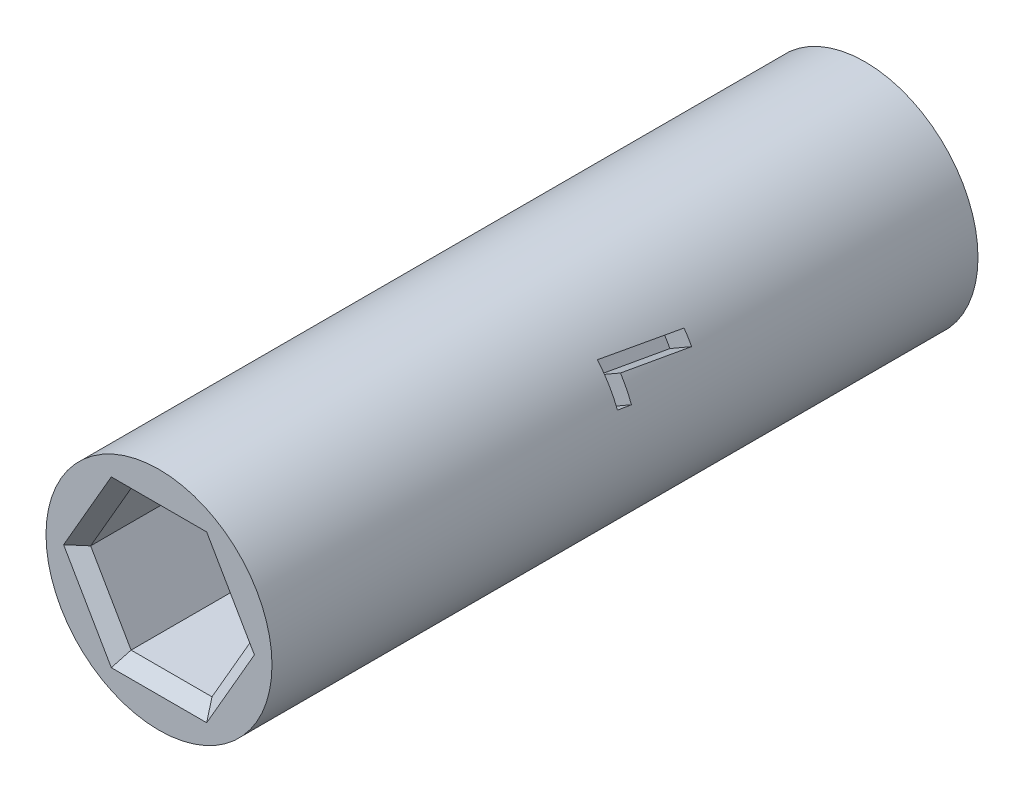
ISO-10303-21;
HEADER;
FILE_DESCRIPTION(('STEP AP214'),'2;1');
FILE_NAME('part.step','',(''),(''),'','','');
FILE_SCHEMA(('AUTOMOTIVE_DESIGN { 1 0 10303 214 1 1 1 1 }'));
ENDSEC;
DATA;
#1=APPLICATION_CONTEXT('core data for automotive mechanical design processes');
#2=APPLICATION_PROTOCOL_DEFINITION('international standard','automotive_design',2000,#1);
#3=PRODUCT_CONTEXT('',#1,'mechanical');
#4=PRODUCT('Part','Part','',(#3));
#5=PRODUCT_RELATED_PRODUCT_CATEGORY('part','',(#4));
#6=PRODUCT_DEFINITION_FORMATION('','',#4);
#7=PRODUCT_DEFINITION_CONTEXT('part definition',#1,'design');
#8=PRODUCT_DEFINITION('design','',#6,#7);
#9=PRODUCT_DEFINITION_SHAPE('','',#8);
#10=(LENGTH_UNIT() NAMED_UNIT(*) SI_UNIT(.MILLI.,.METRE.));
#11=(NAMED_UNIT(*) PLANE_ANGLE_UNIT() SI_UNIT($,.RADIAN.));
#12=(NAMED_UNIT(*) SI_UNIT($,.STERADIAN.) SOLID_ANGLE_UNIT());
#13=UNCERTAINTY_MEASURE_WITH_UNIT(LENGTH_MEASURE(1.E-05),#10,'distance_accuracy_value','');
#14=(GEOMETRIC_REPRESENTATION_CONTEXT(3) GLOBAL_UNCERTAINTY_ASSIGNED_CONTEXT((#13)) GLOBAL_UNIT_ASSIGNED_CONTEXT((#10,
#11,#12)) REPRESENTATION_CONTEXT('',''));
#15=CARTESIAN_POINT('',(0.,0.,0.));
#16=DIRECTION('',(0.,0.,1.));
#17=DIRECTION('',(1.,0.,0.));
#18=AXIS2_PLACEMENT_3D('',#15,#16,#17);
#19=CARTESIAN_POINT('',(0.,0.,0.));
#20=DIRECTION('',(0.,0.,1.));
#21=DIRECTION('',(1.,0.,0.));
#22=AXIS2_PLACEMENT_3D('',#19,#20,#21);
#23=CYLINDRICAL_SURFACE('',#22,4.5);
#24=CARTESIAN_POINT('',(0.,0.,-45.61709914));
#25=DIRECTION('',(0.,0.,1.));
#26=DIRECTION('',(1.,0.,0.));
#27=AXIS2_PLACEMENT_3D('',#24,#25,#26);
#28=CIRCLE('',#27,4.5);
#29=CARTESIAN_POINT('',(4.5,0.,-45.61709914));
#30=VERTEX_POINT('',#29);
#31=EDGE_CURVE('E322',#30,#30,#28,.T.);
#32=ORIENTED_EDGE('',*,*,#31,.T.);
#33=EDGE_LOOP('',(#32));
#34=FACE_BOUND('',#33,.T.);
#35=CARTESIAN_POINT('',(0.,0.,-17.5));
#36=DIRECTION('',(0.,0.,1.));
#37=DIRECTION('',(1.,0.,0.));
#38=AXIS2_PLACEMENT_3D('',#35,#36,#37);
#39=CIRCLE('',#38,4.5);
#40=CARTESIAN_POINT('',(4.5,0.,-17.5));
#41=VERTEX_POINT('',#40);
#42=EDGE_CURVE('E345',#41,#41,#39,.T.);
#43=ORIENTED_EDGE('',*,*,#42,.F.);
#44=EDGE_LOOP('',(#43));
#45=FACE_BOUND('',#44,.T.);
#46=CARTESIAN_POINT('',(0.,0.,-34.73354957));
#47=DIRECTION('',(0.,0.,1.));
#48=DIRECTION('',(1.,0.,0.));
#49=AXIS2_PLACEMENT_3D('',#46,#47,#48);
#50=CIRCLE('',#49,4.5);
#51=CARTESIAN_POINT('',(3.97775975551135,2.10414527241687,-34.73354957));
#52=VERTEX_POINT('',#51);
#53=CARTESIAN_POINT('',(3.67613954755556,2.59538013148324,-34.73354957));
#54=VERTEX_POINT('',#53);
#55=EDGE_CURVE('E57',#52,#54,#50,.T.);
#56=ORIENTED_EDGE('',*,*,#55,.F.);
#57=CARTESIAN_POINT('',(0.,0.,-33.5465489992237));
#58=DIRECTION('',(-0.495144688995939,0.857615758438855,-0.139021393448859));
#59=DIRECTION('',(-0.0695106967244298,0.120396058396224,0.990289377991877));
#60=AXIS2_PLACEMENT_3D('',#57,#58,#59);
#61=ELLIPSE('',#60,32.3691187979307,4.5);
#62=CARTESIAN_POINT('',(3.79067750760948,2.4250286664911,-32.0877162366667));
#63=VERTEX_POINT('',#62);
#64=EDGE_CURVE('E472',#63,#52,#61,.T.);
#65=ORIENTED_EDGE('',*,*,#64,.F.);
#66=CARTESIAN_POINT('',(0.,0.,-32.0877162366667));
#67=DIRECTION('',(0.,0.,1.));
#68=DIRECTION('',(1.,0.,0.));
#69=AXIS2_PLACEMENT_3D('',#66,#67,#68);
#70=CIRCLE('',#69,4.5);
#71=CARTESIAN_POINT('',(4.22582522076293,1.54673889314389,-32.0877162366667));
#72=VERTEX_POINT('',#71);
#73=EDGE_CURVE('E469',#72,#63,#70,.T.);
#74=ORIENTED_EDGE('',*,*,#73,.F.);
#75=CARTESIAN_POINT('',(0.,0.,-26.1296915453087));
#76=DIRECTION('',(-0.495839989793912,0.858820054747488,-0.128727689658036));
#77=DIRECTION('',(-0.0643638448290181,0.111481449414338,0.991679979587823));
#78=AXIS2_PLACEMENT_3D('',#75,#76,#77);
#79=ELLIPSE('',#78,34.9575138958387,4.5);
#80=CARTESIAN_POINT('',(4.20138487407123,1.61194452135472,-31.55854957));
#81=VERTEX_POINT('',#80);
#82=EDGE_CURVE('E465',#81,#72,#79,.T.);
#83=ORIENTED_EDGE('',*,*,#82,.F.);
#84=CARTESIAN_POINT('',(0.,0.,-31.55854957));
#85=DIRECTION('',(0.,0.,-1.));
#86=DIRECTION('',(-1.,0.,0.));
#87=AXIS2_PLACEMENT_3D('',#84,#85,#86);
#88=CIRCLE('',#87,4.5);
#89=CARTESIAN_POINT('',(3.39875321503414,2.94931798612749,-31.55854957));
#90=VERTEX_POINT('',#89);
#91=EDGE_CURVE('E423',#90,#81,#88,.T.);
#92=ORIENTED_EDGE('',*,*,#91,.F.);
#93=CARTESIAN_POINT('',(0.,0.,-37.65454957));
#94=DIRECTION('',(0.495155607363295,-0.857634669605851,0.138865755270155));
#95=DIRECTION('',(-0.0694328776350774,0.120261271779667,0.990311214726588));
#96=AXIS2_PLACEMENT_3D('',#93,#94,#95);
#97=ELLIPSE('',#96,32.4053975095986,4.5);
#98=EDGE_CURVE('E11',#54,#90,#97,.T.);
#99=ORIENTED_EDGE('',*,*,#98,.F.);
#100=EDGE_LOOP('',(#56,#65,#74,#83,#92,#99));
#101=FACE_BOUND('',#100,.T.);
#102=ADVANCED_FACE('F47',(#34,#45,#101),#23,.T.);
#103=CARTESIAN_POINT('',(0.,0.,-17.5));
#104=DIRECTION('',(0.,0.,1.));
#105=DIRECTION('',(1.,0.,0.));
#106=AXIS2_PLACEMENT_3D('',#103,#104,#105);
#107=PLANE('',#106);
#108=DIRECTION('',(1.,0.,0.));
#109=VECTOR('',#108,1.);
#110=CARTESIAN_POINT('',(1.61080725103906,3.29000000000001,-17.5));
#111=LINE('',#110,#109);
#112=CARTESIAN_POINT('',(-1.89948238563387,3.29000000000001,-17.5));
#113=VERTEX_POINT('',#112);
#114=CARTESIAN_POINT('',(1.89948238563387,3.29000000000001,-17.5));
#115=VERTEX_POINT('',#114);
#116=EDGE_CURVE('E353',#113,#115,#111,.T.);
#117=ORIENTED_EDGE('',*,*,#116,.T.);
#118=DIRECTION('',(0.5,-0.866025403784439,0.));
#119=VECTOR('',#118,1.);
#120=CARTESIAN_POINT('',(3.65462720397034,0.250000000000004,-17.5));
#121=LINE('',#120,#119);
#122=CARTESIAN_POINT('',(3.79896477126775,0.,-17.5));
#123=VERTEX_POINT('',#122);
#124=EDGE_CURVE('E368',#115,#123,#121,.T.);
#125=ORIENTED_EDGE('',*,*,#124,.T.);
#126=DIRECTION('',(-0.5,-0.866025403784439,0.));
#127=VECTOR('',#126,1.);
#128=CARTESIAN_POINT('',(2.04381995293128,-3.04,-17.5));
#129=LINE('',#128,#127);
#130=CARTESIAN_POINT('',(1.89948238563387,-3.29000000000001,-17.5));
#131=VERTEX_POINT('',#130);
#132=EDGE_CURVE('E365',#123,#131,#129,.T.);
#133=ORIENTED_EDGE('',*,*,#132,.T.);
#134=DIRECTION('',(-1.,0.,0.));
#135=VECTOR('',#134,1.);
#136=CARTESIAN_POINT('',(-1.61080725103905,-3.29000000000001,-17.5));
#137=LINE('',#136,#135);
#138=CARTESIAN_POINT('',(-1.89948238563387,-3.29000000000001,-17.5));
#139=VERTEX_POINT('',#138);
#140=EDGE_CURVE('E362',#131,#139,#137,.T.);
#141=ORIENTED_EDGE('',*,*,#140,.T.);
#142=DIRECTION('',(-0.5,0.866025403784439,0.));
#143=VECTOR('',#142,1.);
#144=CARTESIAN_POINT('',(-3.65462720397034,-0.250000000000005,-17.5));
#145=LINE('',#144,#143);
#146=CARTESIAN_POINT('',(-3.79896477126775,0.,-17.5));
#147=VERTEX_POINT('',#146);
#148=EDGE_CURVE('E359',#139,#147,#145,.T.);
#149=ORIENTED_EDGE('',*,*,#148,.T.);
#150=DIRECTION('',(0.5,0.866025403784439,0.));
#151=VECTOR('',#150,1.);
#152=CARTESIAN_POINT('',(-2.04381995293128,3.04,-17.5));
#153=LINE('',#152,#151);
#154=EDGE_CURVE('E356',#147,#113,#153,.T.);
#155=ORIENTED_EDGE('',*,*,#154,.T.);
#156=EDGE_LOOP('',(#117,#125,#133,#141,#149,#155));
#157=FACE_BOUND('',#156,.T.);
#158=ORIENTED_EDGE('',*,*,#42,.T.);
#159=EDGE_LOOP('',(#158));
#160=FACE_BOUND('',#159,.T.);
#161=ADVANCED_FACE('F523',(#157,#160),#107,.T.);
#162=CARTESIAN_POINT('',(-4.5,0.,-45.61709914));
#163=DIRECTION('',(0.,0.,-1.));
#164=DIRECTION('',(-1.,0.,0.));
#165=AXIS2_PLACEMENT_3D('',#162,#163,#164);
#166=PLANE('',#165);
#167=DIRECTION('',(-0.5,0.866025403784439,0.));
#168=VECTOR('',#167,1.);
#169=CARTESIAN_POINT('',(2.04381995293127,3.04,-45.61709914));
#170=LINE('',#169,#168);
#171=CARTESIAN_POINT('',(3.79896477126773,0.,-45.61709914));
#172=VERTEX_POINT('',#171);
#173=CARTESIAN_POINT('',(1.89948238563387,3.28999999999999,-45.61709914));
#174=VERTEX_POINT('',#173);
#175=EDGE_CURVE('E391',#172,#174,#170,.T.);
#176=ORIENTED_EDGE('',*,*,#175,.T.);
#177=DIRECTION('',(-1.,0.,0.));
#178=VECTOR('',#177,1.);
#179=CARTESIAN_POINT('',(-1.61080725103906,3.28999999999999,-45.61709914));
#180=LINE('',#179,#178);
#181=CARTESIAN_POINT('',(-1.89948238563387,3.28999999999999,-45.61709914));
#182=VERTEX_POINT('',#181);
#183=EDGE_CURVE('E406',#174,#182,#180,.T.);
#184=ORIENTED_EDGE('',*,*,#183,.T.);
#185=DIRECTION('',(-0.5,-0.866025403784439,0.));
#186=VECTOR('',#185,1.);
#187=CARTESIAN_POINT('',(-3.65462720397033,0.249999999999996,-45.61709914));
#188=LINE('',#187,#186);
#189=CARTESIAN_POINT('',(-3.79896477126773,0.,-45.61709914));
#190=VERTEX_POINT('',#189);
#191=EDGE_CURVE('E403',#182,#190,#188,.T.);
#192=ORIENTED_EDGE('',*,*,#191,.T.);
#193=DIRECTION('',(0.5,-0.866025403784439,0.));
#194=VECTOR('',#193,1.);
#195=CARTESIAN_POINT('',(-2.04381995293127,-3.04,-45.61709914));
#196=LINE('',#195,#194);
#197=CARTESIAN_POINT('',(-1.89948238563387,-3.28999999999999,-45.61709914));
#198=VERTEX_POINT('',#197);
#199=EDGE_CURVE('E400',#190,#198,#196,.T.);
#200=ORIENTED_EDGE('',*,*,#199,.T.);
#201=DIRECTION('',(1.,0.,0.));
#202=VECTOR('',#201,1.);
#203=CARTESIAN_POINT('',(1.61080725103905,-3.29,-45.61709914));
#204=LINE('',#203,#202);
#205=CARTESIAN_POINT('',(1.89948238563386,-3.29,-45.61709914));
#206=VERTEX_POINT('',#205);
#207=EDGE_CURVE('E397',#198,#206,#204,.T.);
#208=ORIENTED_EDGE('',*,*,#207,.T.);
#209=DIRECTION('',(0.5,0.866025403784439,0.));
#210=VECTOR('',#209,1.);
#211=CARTESIAN_POINT('',(3.65462720397033,-0.249999999999999,-45.61709914));
#212=LINE('',#211,#210);
#213=EDGE_CURVE('E394',#206,#172,#212,.T.);
#214=ORIENTED_EDGE('',*,*,#213,.T.);
#215=EDGE_LOOP('',(#176,#184,#192,#200,#208,#214));
#216=FACE_BOUND('',#215,.T.);
#217=ORIENTED_EDGE('',*,*,#31,.F.);
#218=EDGE_LOOP('',(#217));
#219=FACE_BOUND('',#218,.T.);
#220=ADVANCED_FACE('F531',(#216,#219),#166,.T.);
#221=CARTESIAN_POINT('',(3.22161450207811,0.,-24.5));
#222=DIRECTION('',(0.866025403784438,0.5,0.));
#223=DIRECTION('',(-0.5,0.866025403784439,0.));
#224=AXIS2_PLACEMENT_3D('',#221,#222,#223);
#225=PLANE('',#224);
#226=DIRECTION('',(0.,0.,1.));
#227=VECTOR('',#226,1.);
#228=CARTESIAN_POINT('',(3.22161450207811,0.,-24.5));
#229=LINE('',#228,#227);
#230=CARTESIAN_POINT('',(3.22161450207811,0.,-24.5));
#231=VERTEX_POINT('',#230);
#232=CARTESIAN_POINT('',(3.22161450207811,0.,-18.));
#233=VERTEX_POINT('',#232);
#234=EDGE_CURVE('E318',#231,#233,#229,.T.);
#235=ORIENTED_EDGE('',*,*,#234,.T.);
#236=DIRECTION('',(-0.5,0.866025403784439,0.));
#237=VECTOR('',#236,1.);
#238=CARTESIAN_POINT('',(1.61080725103906,2.79,-18.));
#239=LINE('',#238,#237);
#240=CARTESIAN_POINT('',(1.61080725103906,2.79,-18.));
#241=VERTEX_POINT('',#240);
#242=EDGE_CURVE('E349',#233,#241,#239,.T.);
#243=ORIENTED_EDGE('',*,*,#242,.T.);
#244=DIRECTION('',(0.,0.,1.));
#245=VECTOR('',#244,1.);
#246=CARTESIAN_POINT('',(1.61080725103906,2.79,-24.5));
#247=LINE('',#246,#245);
#248=CARTESIAN_POINT('',(1.61080725103906,2.79,-24.5));
#249=VERTEX_POINT('',#248);
#250=EDGE_CURVE('E317',#249,#241,#247,.T.);
#251=ORIENTED_EDGE('',*,*,#250,.F.);
#252=DIRECTION('',(-0.5,0.866025403784438,0.));
#253=VECTOR('',#252,1.);
#254=CARTESIAN_POINT('',(3.22161450207811,0.,-24.5));
#255=LINE('',#254,#253);
#256=EDGE_CURVE('E277',#231,#249,#255,.T.);
#257=ORIENTED_EDGE('',*,*,#256,.F.);
#258=EDGE_LOOP('',(#235,#243,#251,#257));
#259=FACE_BOUND('',#258,.T.);
#260=ADVANCED_FACE('F670',(#259),#225,.F.);
#261=CARTESIAN_POINT('',(1.61080725103906,-2.79,-24.5));
#262=DIRECTION('',(0.866025403784439,-0.5,0.));
#263=DIRECTION('',(0.5,0.866025403784439,0.));
#264=AXIS2_PLACEMENT_3D('',#261,#262,#263);
#265=PLANE('',#264);
#266=DIRECTION('',(0.,0.,1.));
#267=VECTOR('',#266,1.);
#268=CARTESIAN_POINT('',(1.61080725103906,-2.79,-24.5));
#269=LINE('',#268,#267);
#270=CARTESIAN_POINT('',(1.61080725103906,-2.79,-24.5));
#271=VERTEX_POINT('',#270);
#272=CARTESIAN_POINT('',(1.61080725103906,-2.79,-18.));
#273=VERTEX_POINT('',#272);
#274=EDGE_CURVE('E323',#271,#273,#269,.T.);
#275=ORIENTED_EDGE('',*,*,#274,.T.);
#276=DIRECTION('',(0.5,0.866025403784439,0.));
#277=VECTOR('',#276,1.);
#278=CARTESIAN_POINT('',(3.22161450207811,0.,-18.));
#279=LINE('',#278,#277);
#280=EDGE_CURVE('E372',#273,#233,#279,.T.);
#281=ORIENTED_EDGE('',*,*,#280,.T.);
#282=ORIENTED_EDGE('',*,*,#234,.F.);
#283=DIRECTION('',(0.5,0.866025403784439,0.));
#284=VECTOR('',#283,1.);
#285=CARTESIAN_POINT('',(1.61080725103906,-2.79,-24.5));
#286=LINE('',#285,#284);
#287=EDGE_CURVE('E313',#271,#231,#286,.T.);
#288=ORIENTED_EDGE('',*,*,#287,.F.);
#289=EDGE_LOOP('',(#275,#281,#282,#288));
#290=FACE_BOUND('',#289,.T.);
#291=ADVANCED_FACE('F666',(#290),#265,.F.);
#292=CARTESIAN_POINT('',(-1.61080725103905,-2.79,-24.5));
#293=DIRECTION('',(0.,-1.,0.));
#294=DIRECTION('',(1.,0.,0.));
#295=AXIS2_PLACEMENT_3D('',#292,#293,#294);
#296=PLANE('',#295);
#297=DIRECTION('',(0.,0.,1.));
#298=VECTOR('',#297,1.);
#299=CARTESIAN_POINT('',(-1.61080725103905,-2.79,-24.5));
#300=LINE('',#299,#298);
#301=CARTESIAN_POINT('',(-1.61080725103905,-2.79,-24.5));
#302=VERTEX_POINT('',#301);
#303=CARTESIAN_POINT('',(-1.61080725103905,-2.79,-18.));
#304=VERTEX_POINT('',#303);
#305=EDGE_CURVE('E327',#302,#304,#300,.T.);
#306=ORIENTED_EDGE('',*,*,#305,.T.);
#307=DIRECTION('',(1.,0.,0.));
#308=VECTOR('',#307,1.);
#309=CARTESIAN_POINT('',(1.61080725103906,-2.79,-18.));
#310=LINE('',#309,#308);
#311=EDGE_CURVE('E375',#304,#273,#310,.T.);
#312=ORIENTED_EDGE('',*,*,#311,.T.);
#313=ORIENTED_EDGE('',*,*,#274,.F.);
#314=DIRECTION('',(1.,0.,0.));
#315=VECTOR('',#314,1.);
#316=CARTESIAN_POINT('',(-1.61080725103905,-2.79,-24.5));
#317=LINE('',#316,#315);
#318=EDGE_CURVE('E309',#302,#271,#317,.T.);
#319=ORIENTED_EDGE('',*,*,#318,.F.);
#320=EDGE_LOOP('',(#306,#312,#313,#319));
#321=FACE_BOUND('',#320,.T.);
#322=ADVANCED_FACE('F669',(#321),#296,.F.);
#323=CARTESIAN_POINT('',(-3.22161450207811,0.,-24.5));
#324=DIRECTION('',(-0.866025403784438,-0.5,0.));
#325=DIRECTION('',(0.5,-0.866025403784439,0.));
#326=AXIS2_PLACEMENT_3D('',#323,#324,#325);
#327=PLANE('',#326);
#328=DIRECTION('',(0.,0.,1.));
#329=VECTOR('',#328,1.);
#330=CARTESIAN_POINT('',(-3.22161450207811,0.,-24.5));
#331=LINE('',#330,#329);
#332=CARTESIAN_POINT('',(-3.22161450207811,0.,-24.5));
#333=VERTEX_POINT('',#332);
#334=CARTESIAN_POINT('',(-3.22161450207811,0.,-18.));
#335=VERTEX_POINT('',#334);
#336=EDGE_CURVE('E331',#333,#335,#331,.T.);
#337=ORIENTED_EDGE('',*,*,#336,.T.);
#338=DIRECTION('',(0.5,-0.866025403784439,0.));
#339=VECTOR('',#338,1.);
#340=CARTESIAN_POINT('',(-1.61080725103905,-2.79,-18.));
#341=LINE('',#340,#339);
#342=EDGE_CURVE('E378',#335,#304,#341,.T.);
#343=ORIENTED_EDGE('',*,*,#342,.T.);
#344=ORIENTED_EDGE('',*,*,#305,.F.);
#345=DIRECTION('',(0.5,-0.866025403784439,0.));
#346=VECTOR('',#345,1.);
#347=CARTESIAN_POINT('',(-3.22161450207811,0.,-24.5));
#348=LINE('',#347,#346);
#349=EDGE_CURVE('E305',#333,#302,#348,.T.);
#350=ORIENTED_EDGE('',*,*,#349,.F.);
#351=EDGE_LOOP('',(#337,#343,#344,#350));
#352=FACE_BOUND('',#351,.T.);
#353=ADVANCED_FACE('F674',(#352),#327,.F.);
#354=CARTESIAN_POINT('',(-1.61080725103906,2.79,-24.5));
#355=DIRECTION('',(-0.866025403784439,0.5,0.));
#356=DIRECTION('',(-0.5,-0.866025403784439,0.));
#357=AXIS2_PLACEMENT_3D('',#354,#355,#356);
#358=PLANE('',#357);
#359=DIRECTION('',(0.,0.,1.));
#360=VECTOR('',#359,1.);
#361=CARTESIAN_POINT('',(-1.61080725103906,2.79,-24.5));
#362=LINE('',#361,#360);
#363=CARTESIAN_POINT('',(-1.61080725103906,2.79,-24.5));
#364=VERTEX_POINT('',#363);
#365=CARTESIAN_POINT('',(-1.61080725103906,2.79,-18.));
#366=VERTEX_POINT('',#365);
#367=EDGE_CURVE('E335',#364,#366,#362,.T.);
#368=ORIENTED_EDGE('',*,*,#367,.T.);
#369=DIRECTION('',(-0.5,-0.866025403784439,0.));
#370=VECTOR('',#369,1.);
#371=CARTESIAN_POINT('',(-3.22161450207811,0.,-18.));
#372=LINE('',#371,#370);
#373=EDGE_CURVE('E381',#366,#335,#372,.T.);
#374=ORIENTED_EDGE('',*,*,#373,.T.);
#375=ORIENTED_EDGE('',*,*,#336,.F.);
#376=DIRECTION('',(-0.5,-0.866025403784439,0.));
#377=VECTOR('',#376,1.);
#378=CARTESIAN_POINT('',(-1.61080725103906,2.79,-24.5));
#379=LINE('',#378,#377);
#380=EDGE_CURVE('E301',#364,#333,#379,.T.);
#381=ORIENTED_EDGE('',*,*,#380,.F.);
#382=EDGE_LOOP('',(#368,#374,#375,#381));
#383=FACE_BOUND('',#382,.T.);
#384=ADVANCED_FACE('F678',(#383),#358,.F.);
#385=CARTESIAN_POINT('',(1.61080725103906,2.79,-24.5));
#386=DIRECTION('',(0.,1.,0.));
#387=DIRECTION('',(0.,0.,1.));
#388=AXIS2_PLACEMENT_3D('',#385,#386,#387);
#389=PLANE('',#388);
#390=ORIENTED_EDGE('',*,*,#250,.T.);
#391=DIRECTION('',(-1.,0.,0.));
#392=VECTOR('',#391,1.);
#393=CARTESIAN_POINT('',(-1.61080725103906,2.79,-18.));
#394=LINE('',#393,#392);
#395=EDGE_CURVE('E384',#241,#366,#394,.T.);
#396=ORIENTED_EDGE('',*,*,#395,.T.);
#397=ORIENTED_EDGE('',*,*,#367,.F.);
#398=DIRECTION('',(-1.,0.,0.));
#399=VECTOR('',#398,1.);
#400=CARTESIAN_POINT('',(1.61080725103906,2.79,-24.5));
#401=LINE('',#400,#399);
#402=EDGE_CURVE('E297',#249,#364,#401,.T.);
#403=ORIENTED_EDGE('',*,*,#402,.F.);
#404=EDGE_LOOP('',(#390,#396,#397,#403));
#405=FACE_BOUND('',#404,.T.);
#406=ADVANCED_FACE('F664',(#405),#389,.F.);
#407=CARTESIAN_POINT('',(0.,0.,-24.5));
#408=DIRECTION('',(0.,0.,1.));
#409=DIRECTION('',(1.,0.,0.));
#410=AXIS2_PLACEMENT_3D('',#407,#408,#409);
#411=PLANE('',#410);
#412=ORIENTED_EDGE('',*,*,#256,.T.);
#413=ORIENTED_EDGE('',*,*,#402,.T.);
#414=ORIENTED_EDGE('',*,*,#380,.T.);
#415=ORIENTED_EDGE('',*,*,#349,.T.);
#416=ORIENTED_EDGE('',*,*,#318,.T.);
#417=ORIENTED_EDGE('',*,*,#287,.T.);
#418=EDGE_LOOP('',(#412,#413,#414,#415,#416,#417));
#419=FACE_BOUND('',#418,.T.);
#420=ADVANCED_FACE('F661',(#419),#411,.T.);
#421=CARTESIAN_POINT('',(-3.22161450207811,0.,-38.61709914));
#422=DIRECTION('',(-0.866025403784439,0.5,0.));
#423=DIRECTION('',(-0.5,-0.866025403784439,0.));
#424=AXIS2_PLACEMENT_3D('',#421,#422,#423);
#425=PLANE('',#424);
#426=DIRECTION('',(0.,0.,-1.));
#427=VECTOR('',#426,1.);
#428=CARTESIAN_POINT('',(-3.22161450207811,0.,-38.61709914));
#429=LINE('',#428,#427);
#430=CARTESIAN_POINT('',(-3.22161450207811,0.,-38.61709914));
#431=VERTEX_POINT('',#430);
#432=CARTESIAN_POINT('',(-3.22161450207811,0.,-45.11709914));
#433=VERTEX_POINT('',#432);
#434=EDGE_CURVE('E273',#431,#433,#429,.T.);
#435=ORIENTED_EDGE('',*,*,#434,.T.);
#436=DIRECTION('',(0.5,0.866025403784439,0.));
#437=VECTOR('',#436,1.);
#438=CARTESIAN_POINT('',(-1.61080725103906,2.79,-45.11709914));
#439=LINE('',#438,#437);
#440=CARTESIAN_POINT('',(-1.61080725103906,2.79,-45.11709914));
#441=VERTEX_POINT('',#440);
#442=EDGE_CURVE('E410',#433,#441,#439,.T.);
#443=ORIENTED_EDGE('',*,*,#442,.T.);
#444=DIRECTION('',(0.,0.,-1.));
#445=VECTOR('',#444,1.);
#446=CARTESIAN_POINT('',(-1.61080725103906,2.79,-38.61709914));
#447=LINE('',#446,#445);
#448=CARTESIAN_POINT('',(-1.61080725103906,2.79,-38.61709914));
#449=VERTEX_POINT('',#448);
#450=EDGE_CURVE('E272',#449,#441,#447,.T.);
#451=ORIENTED_EDGE('',*,*,#450,.F.);
#452=DIRECTION('',(0.5,0.866025403784439,0.));
#453=VECTOR('',#452,1.);
#454=CARTESIAN_POINT('',(-3.22161450207811,0.,-38.61709914));
#455=LINE('',#454,#453);
#456=EDGE_CURVE('E247',#431,#449,#455,.T.);
#457=ORIENTED_EDGE('',*,*,#456,.F.);
#458=EDGE_LOOP('',(#435,#443,#451,#457));
#459=FACE_BOUND('',#458,.T.);
#460=ADVANCED_FACE('F633',(#459),#425,.F.);
#461=CARTESIAN_POINT('',(-1.61080725103906,-2.79,-38.61709914));
#462=DIRECTION('',(-0.866025403784439,-0.5,0.));
#463=DIRECTION('',(0.5,-0.866025403784439,0.));
#464=AXIS2_PLACEMENT_3D('',#461,#462,#463);
#465=PLANE('',#464);
#466=DIRECTION('',(0.,0.,-1.));
#467=VECTOR('',#466,1.);
#468=CARTESIAN_POINT('',(-1.61080725103906,-2.79,-38.61709914));
#469=LINE('',#468,#467);
#470=CARTESIAN_POINT('',(-1.61080725103906,-2.79,-38.61709914));
#471=VERTEX_POINT('',#470);
#472=CARTESIAN_POINT('',(-1.61080725103906,-2.79,-45.11709914));
#473=VERTEX_POINT('',#472);
#474=EDGE_CURVE('E278',#471,#473,#469,.T.);
#475=ORIENTED_EDGE('',*,*,#474,.T.);
#476=DIRECTION('',(-0.5,0.866025403784439,0.));
#477=VECTOR('',#476,1.);
#478=CARTESIAN_POINT('',(-3.22161450207811,0.,-45.11709914));
#479=LINE('',#478,#477);
#480=EDGE_CURVE('E413',#473,#433,#479,.T.);
#481=ORIENTED_EDGE('',*,*,#480,.T.);
#482=ORIENTED_EDGE('',*,*,#434,.F.);
#483=DIRECTION('',(-0.5,0.866025403784439,0.));
#484=VECTOR('',#483,1.);
#485=CARTESIAN_POINT('',(-1.61080725103906,-2.79,-38.61709914));
#486=LINE('',#485,#484);
#487=EDGE_CURVE('E268',#471,#431,#486,.T.);
#488=ORIENTED_EDGE('',*,*,#487,.F.);
#489=EDGE_LOOP('',(#475,#481,#482,#488));
#490=FACE_BOUND('',#489,.T.);
#491=ADVANCED_FACE('F643',(#490),#465,.F.);
#492=CARTESIAN_POINT('',(1.61080725103905,-2.79,-38.61709914));
#493=DIRECTION('',(0.,-1.,0.));
#494=DIRECTION('',(1.,0.,0.));
#495=AXIS2_PLACEMENT_3D('',#492,#493,#494);
#496=PLANE('',#495);
#497=DIRECTION('',(0.,0.,-1.));
#498=VECTOR('',#497,1.);
#499=CARTESIAN_POINT('',(1.61080725103905,-2.79,-38.61709914));
#500=LINE('',#499,#498);
#501=CARTESIAN_POINT('',(1.61080725103905,-2.79,-38.61709914));
#502=VERTEX_POINT('',#501);
#503=CARTESIAN_POINT('',(1.61080725103905,-2.79,-45.11709914));
#504=VERTEX_POINT('',#503);
#505=EDGE_CURVE('E282',#502,#504,#500,.T.);
#506=ORIENTED_EDGE('',*,*,#505,.T.);
#507=DIRECTION('',(-1.,0.,0.));
#508=VECTOR('',#507,1.);
#509=CARTESIAN_POINT('',(-1.61080725103906,-2.79,-45.11709914));
#510=LINE('',#509,#508);
#511=EDGE_CURVE('E416',#504,#473,#510,.T.);
#512=ORIENTED_EDGE('',*,*,#511,.T.);
#513=ORIENTED_EDGE('',*,*,#474,.F.);
#514=DIRECTION('',(-1.,0.,0.));
#515=VECTOR('',#514,1.);
#516=CARTESIAN_POINT('',(1.61080725103905,-2.79,-38.61709914));
#517=LINE('',#516,#515);
#518=EDGE_CURVE('E264',#502,#471,#517,.T.);
#519=ORIENTED_EDGE('',*,*,#518,.F.);
#520=EDGE_LOOP('',(#506,#512,#513,#519));
#521=FACE_BOUND('',#520,.T.);
#522=ADVANCED_FACE('F645',(#521),#496,.F.);
#523=CARTESIAN_POINT('',(3.22161450207811,0.,-38.61709914));
#524=DIRECTION('',(0.866025403784438,-0.5,0.));
#525=DIRECTION('',(0.5,0.866025403784438,0.));
#526=AXIS2_PLACEMENT_3D('',#523,#524,#525);
#527=PLANE('',#526);
#528=DIRECTION('',(0.,0.,-1.));
#529=VECTOR('',#528,1.);
#530=CARTESIAN_POINT('',(3.22161450207811,0.,-38.61709914));
#531=LINE('',#530,#529);
#532=CARTESIAN_POINT('',(3.22161450207811,0.,-38.61709914));
#533=VERTEX_POINT('',#532);
#534=CARTESIAN_POINT('',(3.22161450207811,0.,-45.11709914));
#535=VERTEX_POINT('',#534);
#536=EDGE_CURVE('E285',#533,#535,#531,.T.);
#537=ORIENTED_EDGE('',*,*,#536,.T.);
#538=DIRECTION('',(-0.5,-0.866025403784438,0.));
#539=VECTOR('',#538,1.);
#540=CARTESIAN_POINT('',(1.61080725103905,-2.79,-45.11709914));
#541=LINE('',#540,#539);
#542=EDGE_CURVE('E71',#535,#504,#541,.T.);
#543=ORIENTED_EDGE('',*,*,#542,.T.);
#544=ORIENTED_EDGE('',*,*,#505,.F.);
#545=DIRECTION('',(-0.5,-0.866025403784438,0.));
#546=VECTOR('',#545,1.);
#547=CARTESIAN_POINT('',(3.22161450207811,0.,-38.61709914));
#548=LINE('',#547,#546);
#549=EDGE_CURVE('E260',#533,#502,#548,.T.);
#550=ORIENTED_EDGE('',*,*,#549,.F.);
#551=EDGE_LOOP('',(#537,#543,#544,#550));
#552=FACE_BOUND('',#551,.T.);
#553=ADVANCED_FACE('F647',(#552),#527,.F.);
#554=CARTESIAN_POINT('',(1.61080725103906,2.79,-38.61709914));
#555=DIRECTION('',(0.866025403784439,0.5,0.));
#556=DIRECTION('',(-0.5,0.866025403784439,0.));
#557=AXIS2_PLACEMENT_3D('',#554,#555,#556);
#558=PLANE('',#557);
#559=DIRECTION('',(0.,0.,-1.));
#560=VECTOR('',#559,1.);
#561=CARTESIAN_POINT('',(1.61080725103906,2.79,-38.61709914));
#562=LINE('',#561,#560);
#563=CARTESIAN_POINT('',(1.61080725103906,2.79,-38.61709914));
#564=VERTEX_POINT('',#563);
#565=CARTESIAN_POINT('',(1.61080725103906,2.79,-45.11709914));
#566=VERTEX_POINT('',#565);
#567=EDGE_CURVE('E288',#564,#566,#562,.T.);
#568=ORIENTED_EDGE('',*,*,#567,.T.);
#569=DIRECTION('',(0.5,-0.866025403784439,0.));
#570=VECTOR('',#569,1.);
#571=CARTESIAN_POINT('',(3.22161450207811,0.,-45.11709914));
#572=LINE('',#571,#570);
#573=EDGE_CURVE('E64',#566,#535,#572,.T.);
#574=ORIENTED_EDGE('',*,*,#573,.T.);
#575=ORIENTED_EDGE('',*,*,#536,.F.);
#576=DIRECTION('',(0.5,-0.866025403784439,0.));
#577=VECTOR('',#576,1.);
#578=CARTESIAN_POINT('',(1.61080725103906,2.79,-38.61709914));
#579=LINE('',#578,#577);
#580=EDGE_CURVE('E256',#564,#533,#579,.T.);
#581=ORIENTED_EDGE('',*,*,#580,.F.);
#582=EDGE_LOOP('',(#568,#574,#575,#581));
#583=FACE_BOUND('',#582,.T.);
#584=ADVANCED_FACE('F648',(#583),#558,.F.);
#585=CARTESIAN_POINT('',(-1.61080725103906,2.79,-38.61709914));
#586=DIRECTION('',(0.,1.,0.));
#587=DIRECTION('',(0.,0.,1.));
#588=AXIS2_PLACEMENT_3D('',#585,#586,#587);
#589=PLANE('',#588);
#590=ORIENTED_EDGE('',*,*,#450,.T.);
#591=DIRECTION('',(1.,0.,0.));
#592=VECTOR('',#591,1.);
#593=CARTESIAN_POINT('',(1.61080725103906,2.79,-45.11709914));
#594=LINE('',#593,#592);
#595=EDGE_CURVE('E387',#441,#566,#594,.T.);
#596=ORIENTED_EDGE('',*,*,#595,.T.);
#597=ORIENTED_EDGE('',*,*,#567,.F.);
#598=DIRECTION('',(1.,0.,0.));
#599=VECTOR('',#598,1.);
#600=CARTESIAN_POINT('',(-1.61080725103906,2.79,-38.61709914));
#601=LINE('',#600,#599);
#602=EDGE_CURVE('E251',#449,#564,#601,.T.);
#603=ORIENTED_EDGE('',*,*,#602,.F.);
#604=EDGE_LOOP('',(#590,#596,#597,#603));
#605=FACE_BOUND('',#604,.T.);
#606=ADVANCED_FACE('F637',(#605),#589,.F.);
#607=CARTESIAN_POINT('',(0.,0.,-38.61709914));
#608=DIRECTION('',(0.,0.,-1.));
#609=DIRECTION('',(-1.,0.,0.));
#610=AXIS2_PLACEMENT_3D('',#607,#608,#609);
#611=PLANE('',#610);
#612=ORIENTED_EDGE('',*,*,#456,.T.);
#613=ORIENTED_EDGE('',*,*,#602,.T.);
#614=ORIENTED_EDGE('',*,*,#580,.T.);
#615=ORIENTED_EDGE('',*,*,#549,.T.);
#616=ORIENTED_EDGE('',*,*,#518,.T.);
#617=ORIENTED_EDGE('',*,*,#487,.T.);
#618=EDGE_LOOP('',(#612,#613,#614,#615,#616,#617));
#619=FACE_BOUND('',#618,.T.);
#620=ADVANCED_FACE('F578',(#619),#611,.T.);
#621=CARTESIAN_POINT('',(-3.22161450207811,0.,-18.));
#622=DIRECTION('',(0.61237243569579,0.353553390593271,0.707106781186552));
#623=DIRECTION('',(-0.5,0.866025403784439,0.));
#624=AXIS2_PLACEMENT_3D('',#621,#622,#623);
#625=PLANE('',#624);
#626=DIRECTION('',(0.755928946018459,0.,-0.654653670707972));
#627=VECTOR('',#626,1.);
#628=CARTESIAN_POINT('',(-3.22161450207811,0.,-18.));
#629=LINE('',#628,#627);
#630=EDGE_CURVE('E439',#147,#335,#629,.T.);
#631=ORIENTED_EDGE('',*,*,#630,.F.);
#632=ORIENTED_EDGE('',*,*,#148,.F.);
#633=DIRECTION('',(0.377964473009229,0.654653670707981,-0.654653670707972));
#634=VECTOR('',#633,1.);
#635=CARTESIAN_POINT('',(-1.61080725103905,-2.79,-18.));
#636=LINE('',#635,#634);
#637=EDGE_CURVE('E252',#304,#139,#636,.F.);
#638=ORIENTED_EDGE('',*,*,#637,.F.);
#639=ORIENTED_EDGE('',*,*,#342,.F.);
#640=EDGE_LOOP('',(#631,#632,#638,#639));
#641=FACE_BOUND('',#640,.T.);
#642=ADVANCED_FACE('F572',(#641),#625,.T.);
#643=CARTESIAN_POINT('',(-1.61080725103905,-2.79,-18.));
#644=DIRECTION('',(0.,0.707106781186542,0.707106781186552));
#645=DIRECTION('',(-1.,0.,0.));
#646=AXIS2_PLACEMENT_3D('',#643,#644,#645);
#647=PLANE('',#646);
#648=ORIENTED_EDGE('',*,*,#637,.T.);
#649=ORIENTED_EDGE('',*,*,#140,.F.);
#650=DIRECTION('',(-0.37796447300923,0.654653670707981,-0.654653670707972));
#651=VECTOR('',#650,1.);
#652=CARTESIAN_POINT('',(1.61080725103906,-2.79,-18.));
#653=LINE('',#652,#651);
#654=EDGE_CURVE('E435',#273,#131,#653,.F.);
#655=ORIENTED_EDGE('',*,*,#654,.F.);
#656=ORIENTED_EDGE('',*,*,#311,.F.);
#657=EDGE_LOOP('',(#648,#649,#655,#656));
#658=FACE_BOUND('',#657,.T.);
#659=ADVANCED_FACE('F565',(#658),#647,.T.);
#660=CARTESIAN_POINT('',(-1.61080725103906,2.79,-18.));
#661=DIRECTION('',(0.61237243569579,-0.353553390593271,0.707106781186553));
#662=DIRECTION('',(0.5,0.866025403784439,0.));
#663=AXIS2_PLACEMENT_3D('',#660,#661,#662);
#664=PLANE('',#663);
#665=ORIENTED_EDGE('',*,*,#630,.T.);
#666=ORIENTED_EDGE('',*,*,#373,.F.);
#667=DIRECTION('',(0.377964473009231,-0.654653670707981,-0.654653670707972));
#668=VECTOR('',#667,1.);
#669=CARTESIAN_POINT('',(-1.61080725103906,2.79,-18.));
#670=LINE('',#669,#668);
#671=EDGE_CURVE('E431',#113,#366,#670,.T.);
#672=ORIENTED_EDGE('',*,*,#671,.F.);
#673=ORIENTED_EDGE('',*,*,#154,.F.);
#674=EDGE_LOOP('',(#665,#666,#672,#673));
#675=FACE_BOUND('',#674,.T.);
#676=ADVANCED_FACE('F558',(#675),#664,.T.);
#677=CARTESIAN_POINT('',(1.61080725103906,-2.79,-18.));
#678=DIRECTION('',(-0.61237243569579,0.353553390593271,0.707106781186553));
#679=DIRECTION('',(-0.5,-0.866025403784439,0.));
#680=AXIS2_PLACEMENT_3D('',#677,#678,#679);
#681=PLANE('',#680);
#682=ORIENTED_EDGE('',*,*,#654,.T.);
#683=ORIENTED_EDGE('',*,*,#132,.F.);
#684=DIRECTION('',(-0.755928946018459,0.,-0.654653670707972));
#685=VECTOR('',#684,1.);
#686=CARTESIAN_POINT('',(3.22161450207811,0.,-18.));
#687=LINE('',#686,#685);
#688=EDGE_CURVE('E427',#233,#123,#687,.F.);
#689=ORIENTED_EDGE('',*,*,#688,.F.);
#690=ORIENTED_EDGE('',*,*,#280,.F.);
#691=EDGE_LOOP('',(#682,#683,#689,#690));
#692=FACE_BOUND('',#691,.T.);
#693=ADVANCED_FACE('F551',(#692),#681,.T.);
#694=CARTESIAN_POINT('',(1.61080725103906,2.79,-18.));
#695=DIRECTION('',(0.,-0.707106781186542,0.707106781186552));
#696=DIRECTION('',(1.,0.,0.));
#697=AXIS2_PLACEMENT_3D('',#694,#695,#696);
#698=PLANE('',#697);
#699=ORIENTED_EDGE('',*,*,#671,.T.);
#700=ORIENTED_EDGE('',*,*,#395,.F.);
#701=DIRECTION('',(0.377964473009229,0.654653670707981,0.654653670707972));
#702=VECTOR('',#701,1.);
#703=CARTESIAN_POINT('',(1.15057660788503,1.99285714285713,-18.7971428571429));
#704=LINE('',#703,#702);
#705=EDGE_CURVE('E424',#115,#241,#704,.F.);
#706=ORIENTED_EDGE('',*,*,#705,.F.);
#707=ORIENTED_EDGE('',*,*,#116,.F.);
#708=EDGE_LOOP('',(#699,#700,#706,#707));
#709=FACE_BOUND('',#708,.T.);
#710=ADVANCED_FACE('F544',(#709),#698,.T.);
#711=CARTESIAN_POINT('',(3.22161450207811,0.,-18.));
#712=DIRECTION('',(-0.61237243569579,-0.353553390593271,0.707106781186552));
#713=DIRECTION('',(0.5,-0.866025403784439,0.));
#714=AXIS2_PLACEMENT_3D('',#711,#712,#713);
#715=PLANE('',#714);
#716=ORIENTED_EDGE('',*,*,#688,.T.);
#717=ORIENTED_EDGE('',*,*,#124,.F.);
#718=ORIENTED_EDGE('',*,*,#705,.T.);
#719=ORIENTED_EDGE('',*,*,#242,.F.);
#720=EDGE_LOOP('',(#716,#717,#718,#719));
#721=FACE_BOUND('',#720,.T.);
#722=ADVANCED_FACE('F538',(#721),#715,.T.);
#723=CARTESIAN_POINT('',(1.61080725103905,-2.79,-45.11709914));
#724=DIRECTION('',(0.,0.707106781186548,-0.707106781186547));
#725=DIRECTION('',(1.,0.,0.));
#726=AXIS2_PLACEMENT_3D('',#723,#724,#725);
#727=PLANE('',#726);
#728=DIRECTION('',(-0.377964473009227,0.654653670707977,0.654653670707977));
#729=VECTOR('',#728,1.);
#730=CARTESIAN_POINT('',(1.61080725103905,-2.79,-45.11709914));
#731=LINE('',#730,#729);
#732=EDGE_CURVE('E456',#206,#504,#731,.T.);
#733=ORIENTED_EDGE('',*,*,#732,.F.);
#734=ORIENTED_EDGE('',*,*,#207,.F.);
#735=DIRECTION('',(0.377964473009227,0.654653670707977,0.654653670707977));
#736=VECTOR('',#735,1.);
#737=CARTESIAN_POINT('',(-1.61080725103906,-2.79,-45.11709914));
#738=LINE('',#737,#736);
#739=EDGE_CURVE('E428',#473,#198,#738,.F.);
#740=ORIENTED_EDGE('',*,*,#739,.F.);
#741=ORIENTED_EDGE('',*,*,#511,.F.);
#742=EDGE_LOOP('',(#733,#734,#740,#741));
#743=FACE_BOUND('',#742,.T.);
#744=ADVANCED_FACE('F50',(#743),#727,.T.);
#745=CARTESIAN_POINT('',(-1.61080725103906,-2.79,-45.11709914));
#746=DIRECTION('',(0.612372435695795,0.353553390593274,-0.707106781186547));
#747=DIRECTION('',(0.5,-0.866025403784439,0.));
#748=AXIS2_PLACEMENT_3D('',#745,#746,#747);
#749=PLANE('',#748);
#750=ORIENTED_EDGE('',*,*,#739,.T.);
#751=ORIENTED_EDGE('',*,*,#199,.F.);
#752=DIRECTION('',(0.755928946018454,0.,0.654653670707977));
#753=VECTOR('',#752,1.);
#754=CARTESIAN_POINT('',(-3.22161450207811,0.,-45.11709914));
#755=LINE('',#754,#753);
#756=EDGE_CURVE('E452',#433,#190,#755,.F.);
#757=ORIENTED_EDGE('',*,*,#756,.F.);
#758=ORIENTED_EDGE('',*,*,#480,.F.);
#759=EDGE_LOOP('',(#750,#751,#757,#758));
#760=FACE_BOUND('',#759,.T.);
#761=ADVANCED_FACE('F606',(#760),#749,.T.);
#762=CARTESIAN_POINT('',(3.22161450207811,0.,-45.11709914));
#763=DIRECTION('',(-0.612372435695794,0.353553390593274,-0.707106781186548));
#764=DIRECTION('',(0.5,0.866025403784438,0.));
#765=AXIS2_PLACEMENT_3D('',#762,#763,#764);
#766=PLANE('',#765);
#767=ORIENTED_EDGE('',*,*,#732,.T.);
#768=ORIENTED_EDGE('',*,*,#542,.F.);
#769=DIRECTION('',(-0.755928946018455,0.,0.654653670707977));
#770=VECTOR('',#769,1.);
#771=CARTESIAN_POINT('',(3.22161450207811,0.,-45.11709914));
#772=LINE('',#771,#770);
#773=EDGE_CURVE('E448',#172,#535,#772,.T.);
#774=ORIENTED_EDGE('',*,*,#773,.F.);
#775=ORIENTED_EDGE('',*,*,#213,.F.);
#776=EDGE_LOOP('',(#767,#768,#774,#775));
#777=FACE_BOUND('',#776,.T.);
#778=ADVANCED_FACE('F600',(#777),#766,.T.);
#779=CARTESIAN_POINT('',(-3.22161450207811,0.,-45.11709914));
#780=DIRECTION('',(0.612372435695794,-0.353553390593274,-0.707106781186548));
#781=DIRECTION('',(-0.5,-0.866025403784439,0.));
#782=AXIS2_PLACEMENT_3D('',#779,#780,#781);
#783=PLANE('',#782);
#784=ORIENTED_EDGE('',*,*,#756,.T.);
#785=ORIENTED_EDGE('',*,*,#191,.F.);
#786=DIRECTION('',(0.377964473009227,-0.654653670707977,0.654653670707977));
#787=VECTOR('',#786,1.);
#788=CARTESIAN_POINT('',(-1.61080725103906,2.79,-45.11709914));
#789=LINE('',#788,#787);
#790=EDGE_CURVE('E241',#441,#182,#789,.F.);
#791=ORIENTED_EDGE('',*,*,#790,.F.);
#792=ORIENTED_EDGE('',*,*,#442,.F.);
#793=EDGE_LOOP('',(#784,#785,#791,#792));
#794=FACE_BOUND('',#793,.T.);
#795=ADVANCED_FACE('F593',(#794),#783,.T.);
#796=CARTESIAN_POINT('',(1.61080725103906,2.79,-45.11709914));
#797=DIRECTION('',(-0.612372435695794,-0.353553390593273,-0.707106781186548));
#798=DIRECTION('',(-0.5,0.866025403784439,0.));
#799=AXIS2_PLACEMENT_3D('',#796,#797,#798);
#800=PLANE('',#799);
#801=ORIENTED_EDGE('',*,*,#773,.T.);
#802=ORIENTED_EDGE('',*,*,#573,.F.);
#803=DIRECTION('',(0.377964473009229,0.654653670707977,-0.654653670707977));
#804=VECTOR('',#803,1.);
#805=CARTESIAN_POINT('',(1.15057660788504,1.99285714285714,-44.3199562828571));
#806=LINE('',#805,#804);
#807=EDGE_CURVE('E236',#174,#566,#806,.F.);
#808=ORIENTED_EDGE('',*,*,#807,.F.);
#809=ORIENTED_EDGE('',*,*,#175,.F.);
#810=EDGE_LOOP('',(#801,#802,#808,#809));
#811=FACE_BOUND('',#810,.T.);
#812=ADVANCED_FACE('F586',(#811),#800,.T.);
#813=CARTESIAN_POINT('',(-1.61080725103906,2.79,-45.11709914));
#814=DIRECTION('',(0.,-0.707106781186547,-0.707106781186547));
#815=DIRECTION('',(-1.,0.,0.));
#816=AXIS2_PLACEMENT_3D('',#813,#814,#815);
#817=PLANE('',#816);
#818=ORIENTED_EDGE('',*,*,#790,.T.);
#819=ORIENTED_EDGE('',*,*,#183,.F.);
#820=ORIENTED_EDGE('',*,*,#807,.T.);
#821=ORIENTED_EDGE('',*,*,#595,.F.);
#822=EDGE_LOOP('',(#818,#819,#820,#821));
#823=FACE_BOUND('',#822,.T.);
#824=ADVANCED_FACE('F581',(#823),#817,.T.);
#825=CARTESIAN_POINT('',(2.60368506709169,2.49028517688882,-31.55854957));
#826=DIRECTION('',(0.495155607363295,-0.857634669605851,0.138865755270155));
#827=DIRECTION('',(0.866025403784438,0.500000000000001,0.));
#828=AXIS2_PLACEMENT_3D('',#825,#826,#827);
#829=PLANE('',#828);
#830=ORIENTED_EDGE('',*,*,#98,.T.);
#831=DIRECTION('',(0.866025403784438,0.500000000000001,0.));
#832=VECTOR('',#831,1.);
#833=CARTESIAN_POINT('',(2.60368506709169,2.49028517688882,-31.55854957));
#834=LINE('',#833,#832);
#835=CARTESIAN_POINT('',(2.60368506709169,2.49028517688882,-31.55854957));
#836=VERTEX_POINT('',#835);
#837=EDGE_CURVE('E231',#836,#90,#834,.T.);
#838=ORIENTED_EDGE('',*,*,#837,.F.);
#839=DIRECTION('',(0.0694328776350774,-0.120261271779667,-0.990311214726587));
#840=VECTOR('',#839,1.);
#841=CARTESIAN_POINT('',(2.60368506709169,2.49028517688882,-31.55854957));
#842=LINE('',#841,#840);
#843=CARTESIAN_POINT('',(2.82629123696349,2.10471998059256,-34.73354957));
#844=VERTEX_POINT('',#843);
#845=EDGE_CURVE('E215',#836,#844,#842,.T.);
#846=ORIENTED_EDGE('',*,*,#845,.T.);
#847=DIRECTION('',(0.866025403784438,0.500000000000001,0.));
#848=VECTOR('',#847,1.);
#849=CARTESIAN_POINT('',(2.82629123696349,2.10471998059256,-34.73354957));
#850=LINE('',#849,#848);
#851=EDGE_CURVE('E228',#844,#54,#850,.T.);
#852=ORIENTED_EDGE('',*,*,#851,.T.);
#853=EDGE_LOOP('',(#830,#838,#846,#852));
#854=FACE_BOUND('',#853,.T.);
#855=ADVANCED_FACE('F227',(#854),#829,.T.);
#856=CARTESIAN_POINT('',(2.82629123696349,2.10471998059256,-34.73354957));
#857=DIRECTION('',(0.,0.,1.));
#858=DIRECTION('',(1.,0.,0.));
#859=AXIS2_PLACEMENT_3D('',#856,#857,#858);
#860=PLANE('',#859);
#861=DIRECTION('',(0.866025403784438,0.500000000000001,0.));
#862=VECTOR('',#861,1.);
#863=CARTESIAN_POINT('',(3.11440722254041,1.60568845510055,-34.73354957));
#864=LINE('',#863,#862);
#865=CARTESIAN_POINT('',(3.11440722254041,1.60568845510055,-34.73354957));
#866=VERTEX_POINT('',#865);
#867=EDGE_CURVE('E237',#866,#52,#864,.T.);
#868=ORIENTED_EDGE('',*,*,#867,.T.);
#869=ORIENTED_EDGE('',*,*,#55,.T.);
#870=ORIENTED_EDGE('',*,*,#851,.F.);
#871=DIRECTION('',(0.5,-0.866025403784438,0.));
#872=VECTOR('',#871,1.);
#873=CARTESIAN_POINT('',(2.82629123696349,2.10471998059256,-34.73354957));
#874=LINE('',#873,#872);
#875=EDGE_CURVE('E211',#844,#866,#874,.T.);
#876=ORIENTED_EDGE('',*,*,#875,.T.);
#877=EDGE_LOOP('',(#868,#869,#870,#876));
#878=FACE_BOUND('',#877,.T.);
#879=ADVANCED_FACE('F234',(#878),#860,.T.);
#880=CARTESIAN_POINT('',(3.11440722254041,1.60568845510055,-34.73354957));
#881=DIRECTION('',(-0.495144688995939,0.857615758438855,-0.139021393448859));
#882=DIRECTION('',(-0.866025403784438,-0.500000000000001,0.));
#883=AXIS2_PLACEMENT_3D('',#880,#881,#882);
#884=PLANE('',#883);
#885=ORIENTED_EDGE('',*,*,#64,.T.);
#886=ORIENTED_EDGE('',*,*,#867,.F.);
#887=DIRECTION('',(-0.0695106967244298,0.120396058396224,0.990289377991876));
#888=VECTOR('',#887,1.);
#889=CARTESIAN_POINT('',(3.11440722254041,1.60568845510055,-34.73354957));
#890=LINE('',#889,#888);
#891=CARTESIAN_POINT('',(2.92869007510451,1.92735999029628,-32.0877162366667));
#892=VERTEX_POINT('',#891);
#893=EDGE_CURVE('E217',#866,#892,#890,.T.);
#894=ORIENTED_EDGE('',*,*,#893,.T.);
#895=DIRECTION('',(0.866025403784438,0.500000000000001,0.));
#896=VECTOR('',#895,1.);
#897=CARTESIAN_POINT('',(2.92869007510451,1.92735999029628,-32.0877162366667));
#898=LINE('',#897,#896);
#899=EDGE_CURVE('E243',#892,#63,#898,.T.);
#900=ORIENTED_EDGE('',*,*,#899,.T.);
#901=EDGE_LOOP('',(#885,#886,#894,#900));
#902=FACE_BOUND('',#901,.T.);
#903=ADVANCED_FACE('F479',(#902),#884,.T.);
#904=CARTESIAN_POINT('',(2.92869007510451,1.92735999029628,-32.0877162366667));
#905=DIRECTION('',(0.,0.,1.));
#906=DIRECTION('',(1.,0.,0.));
#907=AXIS2_PLACEMENT_3D('',#904,#905,#906);
#908=PLANE('',#907);
#909=DIRECTION('',(0.866025403784438,0.500000000000001,0.));
#910=VECTOR('',#909,1.);
#911=CARTESIAN_POINT('',(3.41778763119426,1.08021817329108,-32.0877162366667));
#912=LINE('',#911,#910);
#913=CARTESIAN_POINT('',(3.41778763119426,1.08021817329108,-32.0877162366667));
#914=VERTEX_POINT('',#913);
#915=EDGE_CURVE('E493',#914,#72,#912,.T.);
#916=ORIENTED_EDGE('',*,*,#915,.T.);
#917=ORIENTED_EDGE('',*,*,#73,.T.);
#918=ORIENTED_EDGE('',*,*,#899,.F.);
#919=DIRECTION('',(0.5,-0.866025403784438,0.));
#920=VECTOR('',#919,1.);
#921=CARTESIAN_POINT('',(2.92869007510451,1.92735999029628,-32.0877162366667));
#922=LINE('',#921,#920);
#923=EDGE_CURVE('E505',#892,#914,#922,.T.);
#924=ORIENTED_EDGE('',*,*,#923,.T.);
#925=EDGE_LOOP('',(#916,#917,#918,#924));
#926=FACE_BOUND('',#925,.T.);
#927=ADVANCED_FACE('F504',(#926),#908,.T.);
#928=CARTESIAN_POINT('',(3.41778763119426,1.08021817329108,-32.0877162366667));
#929=DIRECTION('',(-0.495839989793912,0.858820054747488,-0.128727689658036));
#930=DIRECTION('',(-0.866025403784438,-0.500000000000001,0.));
#931=AXIS2_PLACEMENT_3D('',#928,#929,#930);
#932=PLANE('',#931);
#933=ORIENTED_EDGE('',*,*,#82,.T.);
#934=ORIENTED_EDGE('',*,*,#915,.F.);
#935=DIRECTION('',(-0.0643638448290182,0.111481449414338,0.991679979587823));
#936=VECTOR('',#935,1.);
#937=CARTESIAN_POINT('',(3.41778763119426,1.08021817329108,-32.0877162366667));
#938=LINE('',#937,#936);
#939=CARTESIAN_POINT('',(3.38344267927118,1.13970537500536,-31.55854957));
#940=VERTEX_POINT('',#939);
#941=EDGE_CURVE('E495',#914,#940,#938,.T.);
#942=ORIENTED_EDGE('',*,*,#941,.T.);
#943=DIRECTION('',(0.866025403784438,0.500000000000001,0.));
#944=VECTOR('',#943,1.);
#945=CARTESIAN_POINT('',(3.38344267927118,1.13970537500536,-31.55854957));
#946=LINE('',#945,#944);
#947=EDGE_CURVE('E489',#940,#81,#946,.T.);
#948=ORIENTED_EDGE('',*,*,#947,.T.);
#949=EDGE_LOOP('',(#933,#934,#942,#948));
#950=FACE_BOUND('',#949,.T.);
#951=ADVANCED_FACE('F508',(#950),#932,.T.);
#952=CARTESIAN_POINT('',(3.38344267927118,1.13970537500536,-31.55854957));
#953=DIRECTION('',(0.,0.,-1.));
#954=DIRECTION('',(-1.,0.,0.));
#955=AXIS2_PLACEMENT_3D('',#952,#953,#954);
#956=PLANE('',#955);
#957=ORIENTED_EDGE('',*,*,#837,.T.);
#958=ORIENTED_EDGE('',*,*,#91,.T.);
#959=ORIENTED_EDGE('',*,*,#947,.F.);
#960=DIRECTION('',(-0.500000000000001,0.866025403784438,0.));
#961=VECTOR('',#960,1.);
#962=CARTESIAN_POINT('',(3.38344267927118,1.13970537500536,-31.55854957));
#963=LINE('',#962,#961);
#964=EDGE_CURVE('E487',#940,#836,#963,.T.);
#965=ORIENTED_EDGE('',*,*,#964,.T.);
#966=EDGE_LOOP('',(#957,#958,#959,#965));
#967=FACE_BOUND('',#966,.T.);
#968=ADVANCED_FACE('F484',(#967),#956,.T.);
#969=CARTESIAN_POINT('',(3.03108891324554,1.75,0.));
#970=DIRECTION('',(-0.866025403784438,-0.500000000000001,0.));
#971=DIRECTION('',(0.500000000000001,-0.866025403784438,0.));
#972=AXIS2_PLACEMENT_3D('',#969,#970,#971);
#973=PLANE('',#972);
#974=ORIENTED_EDGE('',*,*,#845,.F.);
#975=ORIENTED_EDGE('',*,*,#964,.F.);
#976=ORIENTED_EDGE('',*,*,#941,.F.);
#977=ORIENTED_EDGE('',*,*,#923,.F.);
#978=ORIENTED_EDGE('',*,*,#893,.F.);
#979=ORIENTED_EDGE('',*,*,#875,.F.);
#980=EDGE_LOOP('',(#974,#975,#976,#977,#978,#979));
#981=FACE_BOUND('',#980,.T.);
#982=ADVANCED_FACE('F213',(#981),#973,.F.);
#983=CLOSED_SHELL('',(#102,#161,#220,#260,#291,#322,#353,#384,#406,#420,#460,#491,#522,#553,
#584,#606,#620,#642,#659,#676,#693,#710,#722,#744,#761,#778,#795,#812,#824,#855,#879,#903,#927,
#951,#968,#982));
#984=MANIFOLD_SOLID_BREP('B2',#983);
#985=ADVANCED_BREP_SHAPE_REPRESENTATION('',(#18,#984),#14);
#986=SHAPE_DEFINITION_REPRESENTATION(#9,#985);
ENDSEC;
END-ISO-10303-21;
